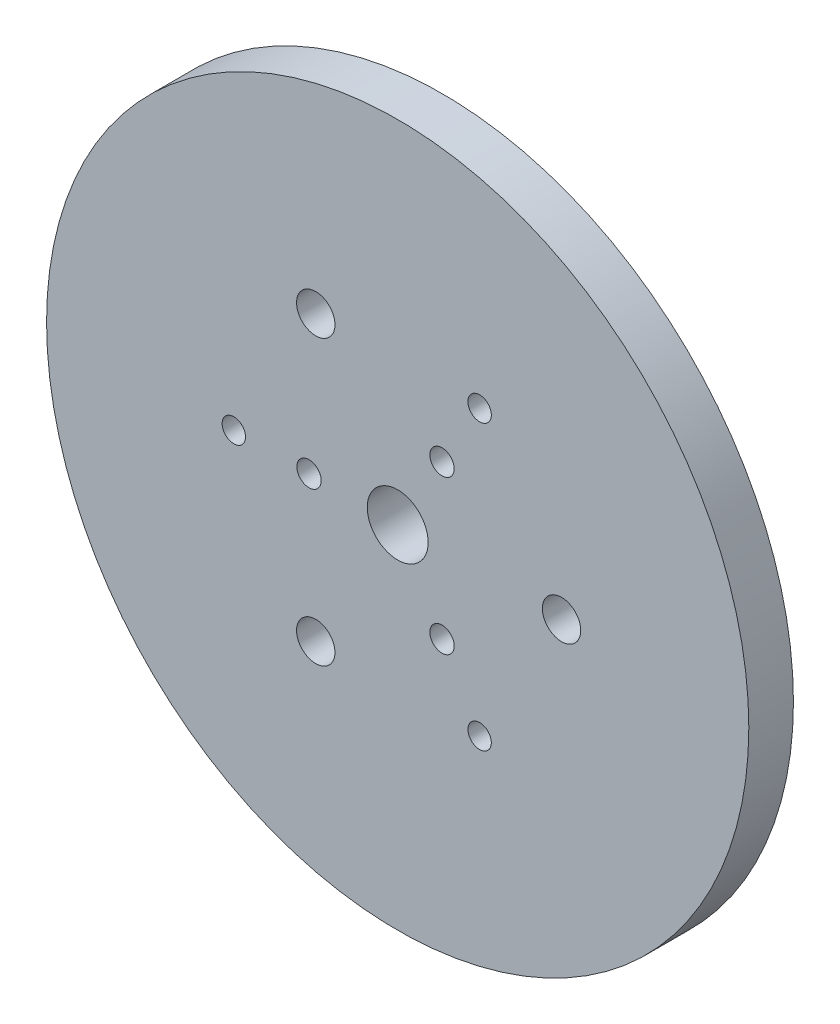
ISO-10303-21;
HEADER;
FILE_DESCRIPTION(('STEP AP214'),'2;1');
FILE_NAME('part.step','',(''),(''),'','','');
FILE_SCHEMA(('AUTOMOTIVE_DESIGN { 1 0 10303 214 1 1 1 1 }'));
ENDSEC;
DATA;
#1=APPLICATION_CONTEXT('core data for automotive mechanical design processes');
#2=APPLICATION_PROTOCOL_DEFINITION('international standard','automotive_design',2000,#1);
#3=PRODUCT_CONTEXT('',#1,'mechanical');
#4=PRODUCT('Part','Part','',(#3));
#5=PRODUCT_RELATED_PRODUCT_CATEGORY('part','',(#4));
#6=PRODUCT_DEFINITION_FORMATION('','',#4);
#7=PRODUCT_DEFINITION_CONTEXT('part definition',#1,'design');
#8=PRODUCT_DEFINITION('design','',#6,#7);
#9=PRODUCT_DEFINITION_SHAPE('','',#8);
#10=(LENGTH_UNIT() NAMED_UNIT(*) SI_UNIT(.MILLI.,.METRE.));
#11=(NAMED_UNIT(*) PLANE_ANGLE_UNIT() SI_UNIT($,.RADIAN.));
#12=(NAMED_UNIT(*) SI_UNIT($,.STERADIAN.) SOLID_ANGLE_UNIT());
#13=UNCERTAINTY_MEASURE_WITH_UNIT(LENGTH_MEASURE(1.E-05),#10,'distance_accuracy_value','');
#14=(GEOMETRIC_REPRESENTATION_CONTEXT(3) GLOBAL_UNCERTAINTY_ASSIGNED_CONTEXT((#13)) GLOBAL_UNIT_ASSIGNED_CONTEXT((#10,
#11,#12)) REPRESENTATION_CONTEXT('',''));
#15=CARTESIAN_POINT('',(0.,0.,0.));
#16=DIRECTION('',(0.,0.,1.));
#17=DIRECTION('',(1.,0.,0.));
#18=AXIS2_PLACEMENT_3D('',#15,#16,#17);
#19=CARTESIAN_POINT('',(0.,0.,9.53));
#20=DIRECTION('',(0.,0.,-1.));
#21=DIRECTION('',(-1.,0.,0.));
#22=AXIS2_PLACEMENT_3D('',#19,#20,#21);
#23=CYLINDRICAL_SURFACE('',#22,75.);
#24=CARTESIAN_POINT('',(0.,0.,9.53));
#25=DIRECTION('',(0.,0.,1.));
#26=DIRECTION('',(1.,0.,0.));
#27=AXIS2_PLACEMENT_3D('',#24,#25,#26);
#28=CIRCLE('',#27,75.);
#29=CARTESIAN_POINT('',(75.,0.,9.53));
#30=VERTEX_POINT('',#29);
#31=EDGE_CURVE('E10',#30,#30,#28,.T.);
#32=ORIENTED_EDGE('',*,*,#31,.F.);
#33=EDGE_LOOP('',(#32));
#34=FACE_BOUND('',#33,.T.);
#35=CARTESIAN_POINT('',(0.,0.,0.));
#36=DIRECTION('',(0.,0.,1.));
#37=DIRECTION('',(1.,0.,0.));
#38=AXIS2_PLACEMENT_3D('',#35,#36,#37);
#39=CIRCLE('',#38,75.);
#40=CARTESIAN_POINT('',(75.,0.,0.));
#41=VERTEX_POINT('',#40);
#42=EDGE_CURVE('E39',#41,#41,#39,.T.);
#43=ORIENTED_EDGE('',*,*,#42,.T.);
#44=EDGE_LOOP('',(#43));
#45=FACE_BOUND('',#44,.T.);
#46=ADVANCED_FACE('F36',(#34,#45),#23,.T.);
#47=CARTESIAN_POINT('',(0.,0.,9.53));
#48=DIRECTION('',(0.,0.,1.));
#49=DIRECTION('',(1.,0.,0.));
#50=AXIS2_PLACEMENT_3D('',#47,#48,#49);
#51=PLANE('',#50);
#52=CARTESIAN_POINT('',(-35.,0.,9.53));
#53=DIRECTION('',(0.,0.,1.));
#54=DIRECTION('',(1.,0.,0.));
#55=AXIS2_PLACEMENT_3D('',#52,#53,#54);
#56=CIRCLE('',#55,2.5);
#57=CARTESIAN_POINT('',(-32.5,0.,9.53));
#58=VERTEX_POINT('',#57);
#59=EDGE_CURVE('E119',#58,#58,#56,.T.);
#60=ORIENTED_EDGE('',*,*,#59,.F.);
#61=EDGE_LOOP('',(#60));
#62=FACE_BOUND('',#61,.T.);
#63=CARTESIAN_POINT('',(17.5,30.3108891324554,9.53));
#64=DIRECTION('',(0.,0.,1.));
#65=DIRECTION('',(1.,0.,0.));
#66=AXIS2_PLACEMENT_3D('',#63,#64,#65);
#67=CIRCLE('',#66,2.50000000000011);
#68=CARTESIAN_POINT('',(20.0000000000001,30.3108891324554,9.53));
#69=VERTEX_POINT('',#68);
#70=EDGE_CURVE('E110',#69,#69,#67,.T.);
#71=ORIENTED_EDGE('',*,*,#70,.F.);
#72=EDGE_LOOP('',(#71));
#73=FACE_BOUND('',#72,.T.);
#74=CARTESIAN_POINT('',(17.5,-30.3108891324554,9.53));
#75=DIRECTION('',(0.,0.,1.));
#76=DIRECTION('',(1.,0.,0.));
#77=AXIS2_PLACEMENT_3D('',#74,#75,#76);
#78=CIRCLE('',#77,2.49999999999968);
#79=CARTESIAN_POINT('',(19.9999999999997,-30.3108891324554,9.53));
#80=VERTEX_POINT('',#79);
#81=EDGE_CURVE('E111',#80,#80,#78,.T.);
#82=ORIENTED_EDGE('',*,*,#81,.F.);
#83=EDGE_LOOP('',(#82));
#84=FACE_BOUND('',#83,.T.);
#85=CARTESIAN_POINT('',(-18.9370888294198,0.,9.53));
#86=DIRECTION('',(0.,0.,1.));
#87=DIRECTION('',(1.,0.,0.));
#88=AXIS2_PLACEMENT_3D('',#85,#86,#87);
#89=CIRCLE('',#88,2.6);
#90=CARTESIAN_POINT('',(-16.3370888294198,0.,9.53));
#91=VERTEX_POINT('',#90);
#92=EDGE_CURVE('E96',#91,#91,#89,.T.);
#93=ORIENTED_EDGE('',*,*,#92,.F.);
#94=EDGE_LOOP('',(#93));
#95=FACE_BOUND('',#94,.T.);
#96=CARTESIAN_POINT('',(9.4685444147099,16.4000000000001,9.53));
#97=DIRECTION('',(0.,0.,1.));
#98=DIRECTION('',(1.,0.,0.));
#99=AXIS2_PLACEMENT_3D('',#96,#97,#98);
#100=CIRCLE('',#99,2.6);
#101=CARTESIAN_POINT('',(12.0685444147099,16.4000000000001,9.53));
#102=VERTEX_POINT('',#101);
#103=EDGE_CURVE('E86',#102,#102,#100,.T.);
#104=ORIENTED_EDGE('',*,*,#103,.F.);
#105=EDGE_LOOP('',(#104));
#106=FACE_BOUND('',#105,.T.);
#107=CARTESIAN_POINT('',(9.46854441470989,-16.4000000000001,9.53));
#108=DIRECTION('',(0.,0.,1.));
#109=DIRECTION('',(1.,0.,0.));
#110=AXIS2_PLACEMENT_3D('',#107,#108,#109);
#111=CIRCLE('',#110,2.6);
#112=CARTESIAN_POINT('',(12.0685444147099,-16.4000000000001,9.53));
#113=VERTEX_POINT('',#112);
#114=EDGE_CURVE('E87',#113,#113,#111,.T.);
#115=ORIENTED_EDGE('',*,*,#114,.F.);
#116=EDGE_LOOP('',(#115));
#117=FACE_BOUND('',#116,.T.);
#118=CARTESIAN_POINT('',(0.,0.,9.53));
#119=DIRECTION('',(0.,0.,1.));
#120=DIRECTION('',(1.,0.,0.));
#121=AXIS2_PLACEMENT_3D('',#118,#119,#120);
#122=CIRCLE('',#121,6.5);
#123=CARTESIAN_POINT('',(6.5,0.,9.53));
#124=VERTEX_POINT('',#123);
#125=EDGE_CURVE('E74',#124,#124,#122,.F.);
#126=ORIENTED_EDGE('',*,*,#125,.T.);
#127=EDGE_LOOP('',(#126));
#128=FACE_BOUND('',#127,.T.);
#129=CARTESIAN_POINT('',(35.,0.,9.53));
#130=DIRECTION('',(0.,0.,1.));
#131=DIRECTION('',(1.,0.,0.));
#132=AXIS2_PLACEMENT_3D('',#129,#130,#131);
#133=CIRCLE('',#132,4.09999999999985);
#134=CARTESIAN_POINT('',(39.0999999999999,0.,9.53));
#135=VERTEX_POINT('',#134);
#136=EDGE_CURVE('E67',#135,#135,#133,.F.);
#137=ORIENTED_EDGE('',*,*,#136,.T.);
#138=EDGE_LOOP('',(#137));
#139=FACE_BOUND('',#138,.T.);
#140=CARTESIAN_POINT('',(-17.4999999999999,30.3108891324554,9.53));
#141=DIRECTION('',(0.,0.,1.));
#142=DIRECTION('',(1.,0.,0.));
#143=AXIS2_PLACEMENT_3D('',#140,#141,#142);
#144=CIRCLE('',#143,4.1);
#145=CARTESIAN_POINT('',(-13.3999999999999,30.3108891324554,9.53));
#146=VERTEX_POINT('',#145);
#147=EDGE_CURVE('E59',#146,#146,#144,.F.);
#148=ORIENTED_EDGE('',*,*,#147,.T.);
#149=EDGE_LOOP('',(#148));
#150=FACE_BOUND('',#149,.T.);
#151=CARTESIAN_POINT('',(-17.5000000000001,-30.3108891324553,9.53));
#152=DIRECTION('',(0.,0.,1.));
#153=DIRECTION('',(1.,0.,0.));
#154=AXIS2_PLACEMENT_3D('',#151,#152,#153);
#155=CIRCLE('',#154,4.10000000000001);
#156=CARTESIAN_POINT('',(-13.4000000000001,-30.3108891324553,9.53));
#157=VERTEX_POINT('',#156);
#158=EDGE_CURVE('E50',#157,#157,#155,.F.);
#159=ORIENTED_EDGE('',*,*,#158,.T.);
#160=EDGE_LOOP('',(#159));
#161=FACE_BOUND('',#160,.T.);
#162=ORIENTED_EDGE('',*,*,#31,.T.);
#163=EDGE_LOOP('',(#162));
#164=FACE_BOUND('',#163,.T.);
#165=ADVANCED_FACE('F133',(#62,#73,#84,#95,#106,#117,#128,#139,#150,#161,#164),#51,.T.);
#166=CARTESIAN_POINT('',(0.,0.,0.));
#167=DIRECTION('',(0.,0.,1.));
#168=DIRECTION('',(1.,0.,0.));
#169=AXIS2_PLACEMENT_3D('',#166,#167,#168);
#170=PLANE('',#169);
#171=CARTESIAN_POINT('',(-35.,0.,0.));
#172=DIRECTION('',(0.,0.,1.));
#173=DIRECTION('',(1.,0.,0.));
#174=AXIS2_PLACEMENT_3D('',#171,#172,#173);
#175=CIRCLE('',#174,2.5);
#176=CARTESIAN_POINT('',(-32.5,0.,0.));
#177=VERTEX_POINT('',#176);
#178=EDGE_CURVE('E91',#177,#177,#175,.F.);
#179=ORIENTED_EDGE('',*,*,#178,.F.);
#180=EDGE_LOOP('',(#179));
#181=FACE_BOUND('',#180,.T.);
#182=CARTESIAN_POINT('',(17.5,30.3108891324554,0.));
#183=DIRECTION('',(0.,0.,1.));
#184=DIRECTION('',(1.,0.,0.));
#185=AXIS2_PLACEMENT_3D('',#182,#183,#184);
#186=CIRCLE('',#185,2.50000000000011);
#187=CARTESIAN_POINT('',(20.0000000000001,30.3108891324554,0.));
#188=VERTEX_POINT('',#187);
#189=EDGE_CURVE('E115',#188,#188,#186,.F.);
#190=ORIENTED_EDGE('',*,*,#189,.F.);
#191=EDGE_LOOP('',(#190));
#192=FACE_BOUND('',#191,.T.);
#193=CARTESIAN_POINT('',(17.5,-30.3108891324554,0.));
#194=DIRECTION('',(0.,0.,1.));
#195=DIRECTION('',(1.,0.,0.));
#196=AXIS2_PLACEMENT_3D('',#193,#194,#195);
#197=CIRCLE('',#196,2.49999999999968);
#198=CARTESIAN_POINT('',(19.9999999999997,-30.3108891324554,0.));
#199=VERTEX_POINT('',#198);
#200=EDGE_CURVE('E106',#199,#199,#197,.F.);
#201=ORIENTED_EDGE('',*,*,#200,.F.);
#202=EDGE_LOOP('',(#201));
#203=FACE_BOUND('',#202,.T.);
#204=CARTESIAN_POINT('',(-18.9370888294198,0.,0.));
#205=DIRECTION('',(0.,0.,1.));
#206=DIRECTION('',(1.,0.,0.));
#207=AXIS2_PLACEMENT_3D('',#204,#205,#206);
#208=CIRCLE('',#207,2.6);
#209=CARTESIAN_POINT('',(-16.3370888294198,0.,0.));
#210=VERTEX_POINT('',#209);
#211=EDGE_CURVE('E78',#210,#210,#208,.F.);
#212=ORIENTED_EDGE('',*,*,#211,.F.);
#213=EDGE_LOOP('',(#212));
#214=FACE_BOUND('',#213,.T.);
#215=CARTESIAN_POINT('',(9.4685444147099,16.4000000000001,0.));
#216=DIRECTION('',(0.,0.,1.));
#217=DIRECTION('',(1.,0.,0.));
#218=AXIS2_PLACEMENT_3D('',#215,#216,#217);
#219=CIRCLE('',#218,2.6);
#220=CARTESIAN_POINT('',(12.0685444147099,16.4000000000001,0.));
#221=VERTEX_POINT('',#220);
#222=EDGE_CURVE('E92',#221,#221,#219,.F.);
#223=ORIENTED_EDGE('',*,*,#222,.F.);
#224=EDGE_LOOP('',(#223));
#225=FACE_BOUND('',#224,.T.);
#226=CARTESIAN_POINT('',(9.46854441470989,-16.4000000000001,0.));
#227=DIRECTION('',(0.,0.,1.));
#228=DIRECTION('',(1.,0.,0.));
#229=AXIS2_PLACEMENT_3D('',#226,#227,#228);
#230=CIRCLE('',#229,2.6);
#231=CARTESIAN_POINT('',(12.0685444147099,-16.4000000000001,0.));
#232=VERTEX_POINT('',#231);
#233=EDGE_CURVE('E82',#232,#232,#230,.F.);
#234=ORIENTED_EDGE('',*,*,#233,.F.);
#235=EDGE_LOOP('',(#234));
#236=FACE_BOUND('',#235,.T.);
#237=CARTESIAN_POINT('',(0.,0.,0.));
#238=DIRECTION('',(0.,0.,-1.));
#239=DIRECTION('',(-1.,0.,0.));
#240=AXIS2_PLACEMENT_3D('',#237,#238,#239);
#241=CIRCLE('',#240,6.5);
#242=CARTESIAN_POINT('',(-6.5,0.,0.));
#243=VERTEX_POINT('',#242);
#244=EDGE_CURVE('E55',#243,#243,#241,.T.);
#245=ORIENTED_EDGE('',*,*,#244,.F.);
#246=EDGE_LOOP('',(#245));
#247=FACE_BOUND('',#246,.T.);
#248=CARTESIAN_POINT('',(35.,0.,0.));
#249=DIRECTION('',(0.,0.,-1.));
#250=DIRECTION('',(-1.,0.,0.));
#251=AXIS2_PLACEMENT_3D('',#248,#249,#250);
#252=CIRCLE('',#251,4.09999999999985);
#253=CARTESIAN_POINT('',(30.9000000000001,0.,0.));
#254=VERTEX_POINT('',#253);
#255=EDGE_CURVE('E48',#254,#254,#252,.T.);
#256=ORIENTED_EDGE('',*,*,#255,.F.);
#257=EDGE_LOOP('',(#256));
#258=FACE_BOUND('',#257,.T.);
#259=CARTESIAN_POINT('',(-17.4999999999999,30.3108891324554,0.));
#260=DIRECTION('',(0.,0.,-1.));
#261=DIRECTION('',(-1.,0.,0.));
#262=AXIS2_PLACEMENT_3D('',#259,#260,#261);
#263=CIRCLE('',#262,4.1);
#264=CARTESIAN_POINT('',(-21.5999999999999,30.3108891324554,0.));
#265=VERTEX_POINT('',#264);
#266=EDGE_CURVE('E63',#265,#265,#263,.T.);
#267=ORIENTED_EDGE('',*,*,#266,.F.);
#268=EDGE_LOOP('',(#267));
#269=FACE_BOUND('',#268,.T.);
#270=CARTESIAN_POINT('',(-17.5000000000001,-30.3108891324553,0.));
#271=DIRECTION('',(0.,0.,-1.));
#272=DIRECTION('',(-1.,0.,0.));
#273=AXIS2_PLACEMENT_3D('',#270,#271,#272);
#274=CIRCLE('',#273,4.10000000000001);
#275=CARTESIAN_POINT('',(-21.6000000000001,-30.3108891324553,0.));
#276=VERTEX_POINT('',#275);
#277=EDGE_CURVE('E54',#276,#276,#274,.T.);
#278=ORIENTED_EDGE('',*,*,#277,.F.);
#279=EDGE_LOOP('',(#278));
#280=FACE_BOUND('',#279,.T.);
#281=ORIENTED_EDGE('',*,*,#42,.F.);
#282=EDGE_LOOP('',(#281));
#283=FACE_BOUND('',#282,.T.);
#284=ADVANCED_FACE('F136',(#181,#192,#203,#214,#225,#236,#247,#258,#269,#280,#283),#170,.F.);
#285=CARTESIAN_POINT('',(-17.5000000000001,-30.3108891324553,9.531));
#286=DIRECTION('',(0.,0.,-1.));
#287=DIRECTION('',(-1.,0.,0.));
#288=AXIS2_PLACEMENT_3D('',#285,#286,#287);
#289=CYLINDRICAL_SURFACE('',#288,4.10000000000001);
#290=ORIENTED_EDGE('',*,*,#158,.F.);
#291=EDGE_LOOP('',(#290));
#292=FACE_BOUND('',#291,.T.);
#293=ORIENTED_EDGE('',*,*,#277,.T.);
#294=EDGE_LOOP('',(#293));
#295=FACE_BOUND('',#294,.T.);
#296=ADVANCED_FACE('F156',(#292,#295),#289,.F.);
#297=CARTESIAN_POINT('',(-17.4999999999999,30.3108891324554,9.531));
#298=DIRECTION('',(0.,0.,-1.));
#299=DIRECTION('',(-1.,0.,0.));
#300=AXIS2_PLACEMENT_3D('',#297,#298,#299);
#301=CYLINDRICAL_SURFACE('',#300,4.1);
#302=ORIENTED_EDGE('',*,*,#147,.F.);
#303=EDGE_LOOP('',(#302));
#304=FACE_BOUND('',#303,.T.);
#305=ORIENTED_EDGE('',*,*,#266,.T.);
#306=EDGE_LOOP('',(#305));
#307=FACE_BOUND('',#306,.T.);
#308=ADVANCED_FACE('F159',(#304,#307),#301,.F.);
#309=CARTESIAN_POINT('',(35.,0.,9.531));
#310=DIRECTION('',(0.,0.,-1.));
#311=DIRECTION('',(-1.,0.,0.));
#312=AXIS2_PLACEMENT_3D('',#309,#310,#311);
#313=CYLINDRICAL_SURFACE('',#312,4.09999999999985);
#314=ORIENTED_EDGE('',*,*,#136,.F.);
#315=EDGE_LOOP('',(#314));
#316=FACE_BOUND('',#315,.T.);
#317=ORIENTED_EDGE('',*,*,#255,.T.);
#318=EDGE_LOOP('',(#317));
#319=FACE_BOUND('',#318,.T.);
#320=ADVANCED_FACE('F196',(#316,#319),#313,.F.);
#321=CARTESIAN_POINT('',(0.,0.,9.531));
#322=DIRECTION('',(0.,0.,-1.));
#323=DIRECTION('',(-1.,0.,0.));
#324=AXIS2_PLACEMENT_3D('',#321,#322,#323);
#325=CYLINDRICAL_SURFACE('',#324,6.5);
#326=ORIENTED_EDGE('',*,*,#125,.F.);
#327=EDGE_LOOP('',(#326));
#328=FACE_BOUND('',#327,.T.);
#329=ORIENTED_EDGE('',*,*,#244,.T.);
#330=EDGE_LOOP('',(#329));
#331=FACE_BOUND('',#330,.T.);
#332=ADVANCED_FACE('F204',(#328,#331),#325,.F.);
#333=CARTESIAN_POINT('',(9.46854441470989,-16.4000000000001,-0.000999999999999265));
#334=DIRECTION('',(0.,0.,1.));
#335=DIRECTION('',(1.,0.,0.));
#336=AXIS2_PLACEMENT_3D('',#333,#334,#335);
#337=CYLINDRICAL_SURFACE('',#336,2.6);
#338=ORIENTED_EDGE('',*,*,#114,.T.);
#339=EDGE_LOOP('',(#338));
#340=FACE_BOUND('',#339,.T.);
#341=ORIENTED_EDGE('',*,*,#233,.T.);
#342=EDGE_LOOP('',(#341));
#343=FACE_BOUND('',#342,.T.);
#344=ADVANCED_FACE('F212',(#340,#343),#337,.F.);
#345=CARTESIAN_POINT('',(9.4685444147099,16.4000000000001,-0.000999999999999265));
#346=DIRECTION('',(0.,0.,1.));
#347=DIRECTION('',(1.,0.,0.));
#348=AXIS2_PLACEMENT_3D('',#345,#346,#347);
#349=CYLINDRICAL_SURFACE('',#348,2.6);
#350=ORIENTED_EDGE('',*,*,#103,.T.);
#351=EDGE_LOOP('',(#350));
#352=FACE_BOUND('',#351,.T.);
#353=ORIENTED_EDGE('',*,*,#222,.T.);
#354=EDGE_LOOP('',(#353));
#355=FACE_BOUND('',#354,.T.);
#356=ADVANCED_FACE('F220',(#352,#355),#349,.F.);
#357=CARTESIAN_POINT('',(-18.9370888294198,0.,-0.000999999999999265));
#358=DIRECTION('',(0.,0.,1.));
#359=DIRECTION('',(1.,0.,0.));
#360=AXIS2_PLACEMENT_3D('',#357,#358,#359);
#361=CYLINDRICAL_SURFACE('',#360,2.6);
#362=ORIENTED_EDGE('',*,*,#92,.T.);
#363=EDGE_LOOP('',(#362));
#364=FACE_BOUND('',#363,.T.);
#365=ORIENTED_EDGE('',*,*,#211,.T.);
#366=EDGE_LOOP('',(#365));
#367=FACE_BOUND('',#366,.T.);
#368=ADVANCED_FACE('F228',(#364,#367),#361,.F.);
#369=CARTESIAN_POINT('',(17.5,-30.3108891324554,-0.000999999999999265));
#370=DIRECTION('',(0.,0.,1.));
#371=DIRECTION('',(1.,0.,0.));
#372=AXIS2_PLACEMENT_3D('',#369,#370,#371);
#373=CYLINDRICAL_SURFACE('',#372,2.49999999999968);
#374=ORIENTED_EDGE('',*,*,#81,.T.);
#375=EDGE_LOOP('',(#374));
#376=FACE_BOUND('',#375,.T.);
#377=ORIENTED_EDGE('',*,*,#200,.T.);
#378=EDGE_LOOP('',(#377));
#379=FACE_BOUND('',#378,.T.);
#380=ADVANCED_FACE('F235',(#376,#379),#373,.F.);
#381=CARTESIAN_POINT('',(17.5,30.3108891324554,-0.000999999999999265));
#382=DIRECTION('',(0.,0.,1.));
#383=DIRECTION('',(1.,0.,0.));
#384=AXIS2_PLACEMENT_3D('',#381,#382,#383);
#385=CYLINDRICAL_SURFACE('',#384,2.50000000000011);
#386=ORIENTED_EDGE('',*,*,#70,.T.);
#387=EDGE_LOOP('',(#386));
#388=FACE_BOUND('',#387,.T.);
#389=ORIENTED_EDGE('',*,*,#189,.T.);
#390=EDGE_LOOP('',(#389));
#391=FACE_BOUND('',#390,.T.);
#392=ADVANCED_FACE('F242',(#388,#391),#385,.F.);
#393=CARTESIAN_POINT('',(-35.,0.,-0.000999999999999265));
#394=DIRECTION('',(0.,0.,1.));
#395=DIRECTION('',(1.,0.,0.));
#396=AXIS2_PLACEMENT_3D('',#393,#394,#395);
#397=CYLINDRICAL_SURFACE('',#396,2.5);
#398=ORIENTED_EDGE('',*,*,#59,.T.);
#399=EDGE_LOOP('',(#398));
#400=FACE_BOUND('',#399,.T.);
#401=ORIENTED_EDGE('',*,*,#178,.T.);
#402=EDGE_LOOP('',(#401));
#403=FACE_BOUND('',#402,.T.);
#404=ADVANCED_FACE('F130',(#400,#403),#397,.F.);
#405=CLOSED_SHELL('',(#46,#165,#284,#296,#308,#320,#332,#344,#356,#368,#380,#392,#404));
#406=MANIFOLD_SOLID_BREP('B2',#405);
#407=ADVANCED_BREP_SHAPE_REPRESENTATION('',(#18,#406),#14);
#408=SHAPE_DEFINITION_REPRESENTATION(#9,#407);
ENDSEC;
END-ISO-10303-21;
